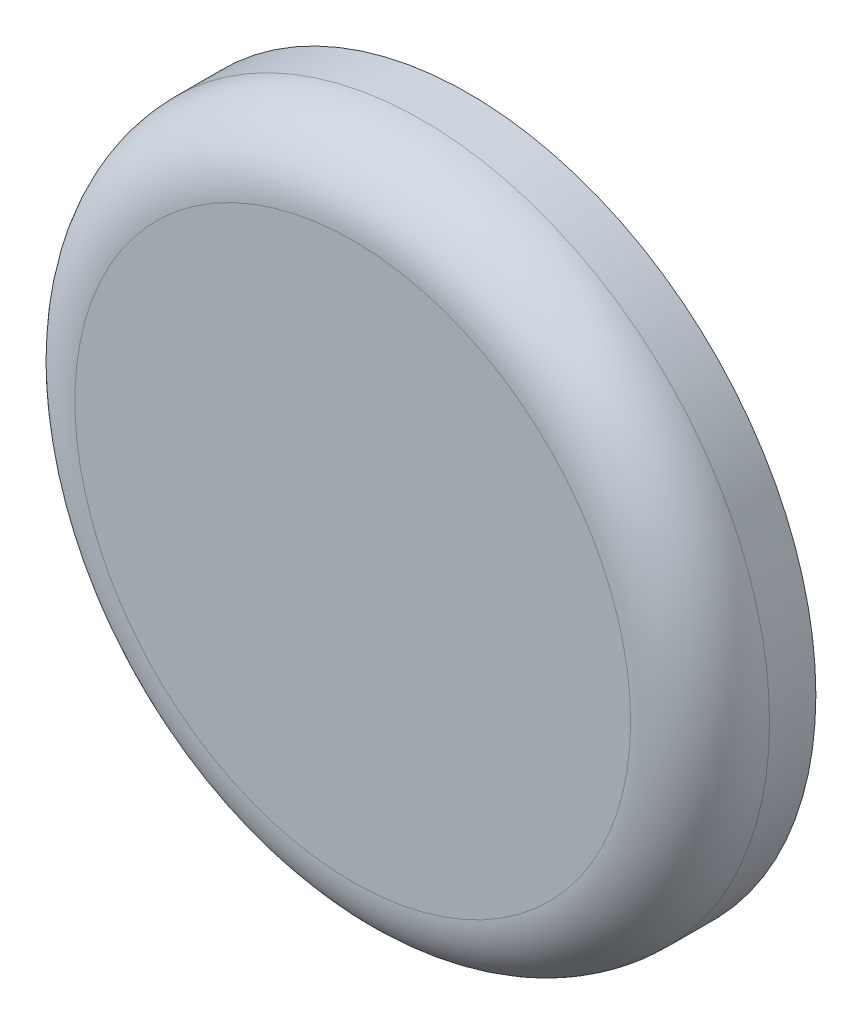
ISO-10303-21;
HEADER;
FILE_DESCRIPTION(('STEP AP214'),'2;1');
FILE_NAME('part.step','',(''),(''),'','','');
FILE_SCHEMA(('AUTOMOTIVE_DESIGN { 1 0 10303 214 1 1 1 1 }'));
ENDSEC;
DATA;
#1=APPLICATION_CONTEXT('core data for automotive mechanical design processes');
#2=APPLICATION_PROTOCOL_DEFINITION('international standard','automotive_design',2000,#1);
#3=PRODUCT_CONTEXT('',#1,'mechanical');
#4=PRODUCT('Part','Part','',(#3));
#5=PRODUCT_RELATED_PRODUCT_CATEGORY('part','',(#4));
#6=PRODUCT_DEFINITION_FORMATION('','',#4);
#7=PRODUCT_DEFINITION_CONTEXT('part definition',#1,'design');
#8=PRODUCT_DEFINITION('design','',#6,#7);
#9=PRODUCT_DEFINITION_SHAPE('','',#8);
#10=(LENGTH_UNIT() NAMED_UNIT(*) SI_UNIT(.MILLI.,.METRE.));
#11=(NAMED_UNIT(*) PLANE_ANGLE_UNIT() SI_UNIT($,.RADIAN.));
#12=(NAMED_UNIT(*) SI_UNIT($,.STERADIAN.) SOLID_ANGLE_UNIT());
#13=UNCERTAINTY_MEASURE_WITH_UNIT(LENGTH_MEASURE(1.E-05),#10,'distance_accuracy_value','');
#14=(GEOMETRIC_REPRESENTATION_CONTEXT(3) GLOBAL_UNCERTAINTY_ASSIGNED_CONTEXT((#13)) GLOBAL_UNIT_ASSIGNED_CONTEXT((#10,
#11,#12)) REPRESENTATION_CONTEXT('',''));
#15=CARTESIAN_POINT('',(0.,0.,0.));
#16=DIRECTION('',(0.,0.,1.));
#17=DIRECTION('',(1.,0.,0.));
#18=AXIS2_PLACEMENT_3D('',#15,#16,#17);
#19=CARTESIAN_POINT('',(0.,0.,5.));
#20=DIRECTION('',(0.,0.,-1.));
#21=DIRECTION('',(-1.,0.,0.));
#22=AXIS2_PLACEMENT_3D('',#19,#20,#21);
#23=CYLINDRICAL_SURFACE('',#22,15.);
#24=CARTESIAN_POINT('',(0.,0.,2.));
#25=DIRECTION('',(0.,0.,1.));
#26=DIRECTION('',(1.,0.,0.));
#27=AXIS2_PLACEMENT_3D('',#24,#25,#26);
#28=CIRCLE('',#27,15.);
#29=CARTESIAN_POINT('',(15.,0.,2.));
#30=VERTEX_POINT('',#29);
#31=EDGE_CURVE('E10',#30,#30,#28,.F.);
#32=ORIENTED_EDGE('',*,*,#31,.T.);
#33=EDGE_LOOP('',(#32));
#34=FACE_BOUND('',#33,.T.);
#35=CARTESIAN_POINT('',(0.,0.,0.));
#36=DIRECTION('',(0.,0.,1.));
#37=DIRECTION('',(1.,0.,0.));
#38=AXIS2_PLACEMENT_3D('',#35,#36,#37);
#39=CIRCLE('',#38,15.);
#40=CARTESIAN_POINT('',(15.,0.,0.));
#41=VERTEX_POINT('',#40);
#42=EDGE_CURVE('E40',#41,#41,#39,.T.);
#43=ORIENTED_EDGE('',*,*,#42,.T.);
#44=EDGE_LOOP('',(#43));
#45=FACE_BOUND('',#44,.T.);
#46=ADVANCED_FACE('F29',(#34,#45),#23,.T.);
#47=CARTESIAN_POINT('',(0.,0.,5.));
#48=DIRECTION('',(0.,0.,1.));
#49=DIRECTION('',(1.,0.,0.));
#50=AXIS2_PLACEMENT_3D('',#47,#48,#49);
#51=PLANE('',#50);
#52=CARTESIAN_POINT('',(0.,0.,5.));
#53=DIRECTION('',(0.,0.,1.));
#54=DIRECTION('',(1.,0.,0.));
#55=AXIS2_PLACEMENT_3D('',#52,#53,#54);
#56=CIRCLE('',#55,12.);
#57=CARTESIAN_POINT('',(12.,0.,5.));
#58=VERTEX_POINT('',#57);
#59=EDGE_CURVE('E36',#58,#58,#56,.T.);
#60=ORIENTED_EDGE('',*,*,#59,.T.);
#61=EDGE_LOOP('',(#60));
#62=FACE_BOUND('',#61,.T.);
#63=ADVANCED_FACE('F50',(#62),#51,.T.);
#64=CARTESIAN_POINT('',(0.,0.,0.));
#65=DIRECTION('',(0.,0.,1.));
#66=DIRECTION('',(1.,0.,0.));
#67=AXIS2_PLACEMENT_3D('',#64,#65,#66);
#68=PLANE('',#67);
#69=ORIENTED_EDGE('',*,*,#42,.F.);
#70=EDGE_LOOP('',(#69));
#71=FACE_BOUND('',#70,.T.);
#72=ADVANCED_FACE('F48',(#71),#68,.F.);
#73=CARTESIAN_POINT('',(0.,0.,2.));
#74=DIRECTION('',(0.,0.,1.));
#75=DIRECTION('',(1.,0.,0.));
#76=AXIS2_PLACEMENT_3D('',#73,#74,#75);
#77=TOROIDAL_SURFACE('',#76,12.,3.);
#78=ORIENTED_EDGE('',*,*,#31,.F.);
#79=EDGE_LOOP('',(#78));
#80=FACE_BOUND('',#79,.T.);
#81=ORIENTED_EDGE('',*,*,#59,.F.);
#82=EDGE_LOOP('',(#81));
#83=FACE_BOUND('',#82,.T.);
#84=ADVANCED_FACE('F31',(#80,#83),#77,.T.);
#85=CLOSED_SHELL('',(#46,#63,#72,#84));
#86=MANIFOLD_SOLID_BREP('B2',#85);
#87=ADVANCED_BREP_SHAPE_REPRESENTATION('',(#18,#86),#14);
#88=SHAPE_DEFINITION_REPRESENTATION(#9,#87);
ENDSEC;
END-ISO-10303-21;
